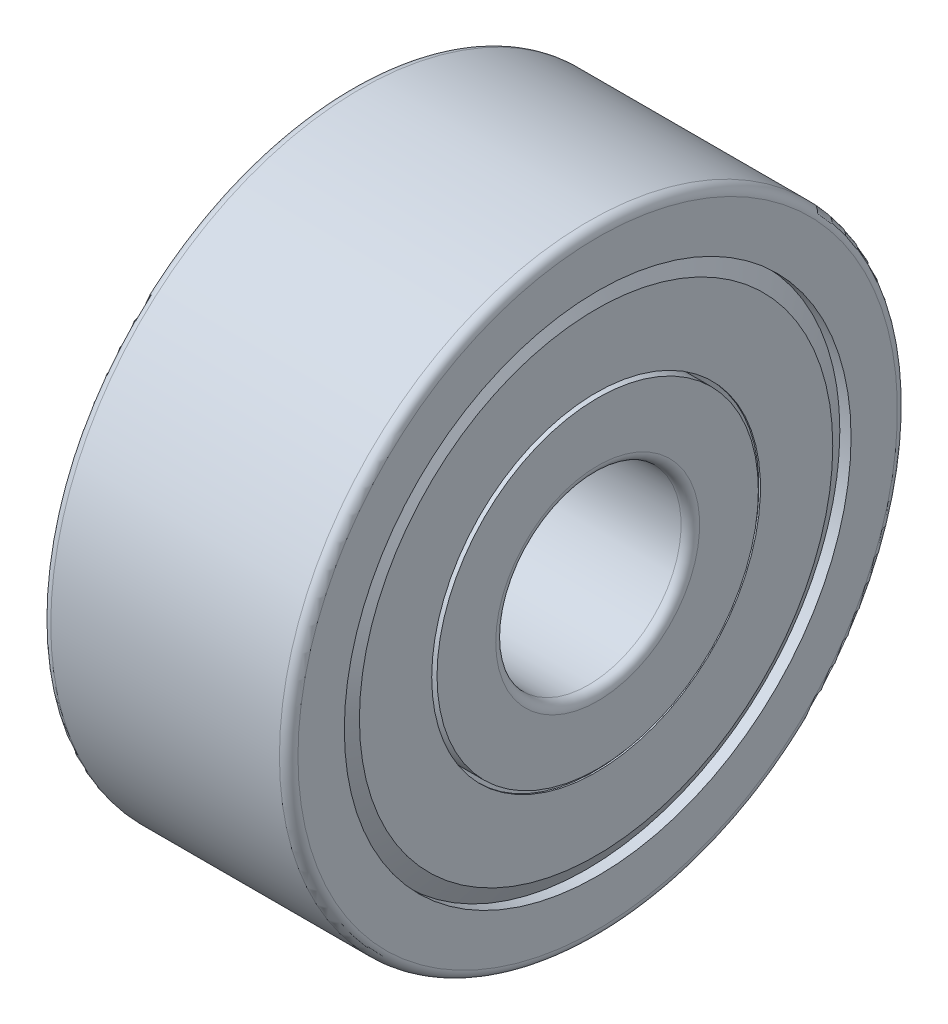
ISO-10303-21;
HEADER;
FILE_DESCRIPTION(('STEP AP214'),'2;1');
FILE_NAME('part.step','',(''),(''),'','','');
FILE_SCHEMA(('AUTOMOTIVE_DESIGN { 1 0 10303 214 1 1 1 1 }'));
ENDSEC;
DATA;
#1=APPLICATION_CONTEXT('core data for automotive mechanical design processes');
#2=APPLICATION_PROTOCOL_DEFINITION('international standard','automotive_design',2000,#1);
#3=PRODUCT_CONTEXT('',#1,'mechanical');
#4=PRODUCT('Part','Part','',(#3));
#5=PRODUCT_RELATED_PRODUCT_CATEGORY('part','',(#4));
#6=PRODUCT_DEFINITION_FORMATION('','',#4);
#7=PRODUCT_DEFINITION_CONTEXT('part definition',#1,'design');
#8=PRODUCT_DEFINITION('design','',#6,#7);
#9=PRODUCT_DEFINITION_SHAPE('','',#8);
#10=(LENGTH_UNIT() NAMED_UNIT(*) SI_UNIT(.MILLI.,.METRE.));
#11=(NAMED_UNIT(*) PLANE_ANGLE_UNIT() SI_UNIT($,.RADIAN.));
#12=(NAMED_UNIT(*) SI_UNIT($,.STERADIAN.) SOLID_ANGLE_UNIT());
#13=UNCERTAINTY_MEASURE_WITH_UNIT(LENGTH_MEASURE(1.E-05),#10,'distance_accuracy_value','');
#14=(GEOMETRIC_REPRESENTATION_CONTEXT(3) GLOBAL_UNCERTAINTY_ASSIGNED_CONTEXT((#13)) GLOBAL_UNIT_ASSIGNED_CONTEXT((#10,
#11,#12)) REPRESENTATION_CONTEXT('',''));
#15=CARTESIAN_POINT('',(0.,0.,0.));
#16=DIRECTION('',(0.,0.,1.));
#17=DIRECTION('',(1.,0.,0.));
#18=AXIS2_PLACEMENT_3D('',#15,#16,#17);
#19=CARTESIAN_POINT('',(4.,0.,0.));
#20=DIRECTION('',(-1.,0.,0.));
#21=DIRECTION('',(0.,0.,1.));
#22=AXIS2_PLACEMENT_3D('',#19,#20,#21);
#23=CYLINDRICAL_SURFACE('',#22,2.6);
#24=CARTESIAN_POINT('',(4.,0.,0.));
#25=DIRECTION('',(-1.,0.,0.));
#26=DIRECTION('',(0.,0.,1.));
#27=AXIS2_PLACEMENT_3D('',#24,#25,#26);
#28=CIRCLE('',#27,2.6);
#29=CARTESIAN_POINT('',(4.,0.,2.6));
#30=VERTEX_POINT('',#29);
#31=EDGE_CURVE('E10',#30,#30,#28,.T.);
#32=ORIENTED_EDGE('',*,*,#31,.T.);
#33=EDGE_LOOP('',(#32));
#34=FACE_BOUND('',#33,.T.);
#35=CARTESIAN_POINT('',(3.11246098558306,0.,0.));
#36=DIRECTION('',(-1.,0.,0.));
#37=DIRECTION('',(0.,0.,1.));
#38=AXIS2_PLACEMENT_3D('',#35,#36,#37);
#39=CIRCLE('',#38,2.6);
#40=CARTESIAN_POINT('',(3.11246098558306,0.,2.6));
#41=VERTEX_POINT('',#40);
#42=EDGE_CURVE('E143',#41,#41,#39,.T.);
#43=ORIENTED_EDGE('',*,*,#42,.F.);
#44=EDGE_LOOP('',(#43));
#45=FACE_BOUND('',#44,.T.);
#46=ADVANCED_FACE('F31',(#34,#45),#23,.T.);
#47=CARTESIAN_POINT('',(4.,2.6,0.));
#48=DIRECTION('',(1.,0.,0.));
#49=DIRECTION('',(0.,0.,-1.));
#50=AXIS2_PLACEMENT_3D('',#47,#48,#49);
#51=PLANE('',#50);
#52=CARTESIAN_POINT('',(4.,0.,0.));
#53=DIRECTION('',(-1.,0.,0.));
#54=DIRECTION('',(0.,0.,1.));
#55=AXIS2_PLACEMENT_3D('',#52,#53,#54);
#56=CIRCLE('',#55,1.65);
#57=CARTESIAN_POINT('',(4.,0.,1.65));
#58=VERTEX_POINT('',#57);
#59=EDGE_CURVE('E37',#58,#58,#56,.T.);
#60=ORIENTED_EDGE('',*,*,#59,.T.);
#61=EDGE_LOOP('',(#60));
#62=FACE_BOUND('',#61,.T.);
#63=ORIENTED_EDGE('',*,*,#31,.F.);
#64=EDGE_LOOP('',(#63));
#65=FACE_BOUND('',#64,.T.);
#66=ADVANCED_FACE('F151',(#62,#65),#51,.T.);
#67=CARTESIAN_POINT('',(3.85,0.,0.));
#68=DIRECTION('',(-1.,0.,0.));
#69=DIRECTION('',(0.,0.,1.));
#70=AXIS2_PLACEMENT_3D('',#67,#68,#69);
#71=TOROIDAL_SURFACE('',#70,1.65,0.15);
#72=CARTESIAN_POINT('',(3.85,0.,0.));
#73=DIRECTION('',(-1.,0.,0.));
#74=DIRECTION('',(0.,0.,1.));
#75=AXIS2_PLACEMENT_3D('',#72,#73,#74);
#76=CIRCLE('',#75,1.5);
#77=CARTESIAN_POINT('',(3.85,0.,1.5));
#78=VERTEX_POINT('',#77);
#79=EDGE_CURVE('E41',#78,#78,#76,.T.);
#80=ORIENTED_EDGE('',*,*,#79,.T.);
#81=EDGE_LOOP('',(#80));
#82=FACE_BOUND('',#81,.T.);
#83=ORIENTED_EDGE('',*,*,#59,.F.);
#84=EDGE_LOOP('',(#83));
#85=FACE_BOUND('',#84,.T.);
#86=ADVANCED_FACE('F155',(#82,#85),#71,.T.);
#87=CARTESIAN_POINT('',(4.,0.,0.));
#88=DIRECTION('',(-1.,0.,0.));
#89=DIRECTION('',(0.,0.,1.));
#90=AXIS2_PLACEMENT_3D('',#87,#88,#89);
#91=CYLINDRICAL_SURFACE('',#90,1.5);
#92=CARTESIAN_POINT('',(0.15,0.,0.));
#93=DIRECTION('',(-1.,0.,0.));
#94=DIRECTION('',(0.,0.,1.));
#95=AXIS2_PLACEMENT_3D('',#92,#93,#94);
#96=CIRCLE('',#95,1.5);
#97=CARTESIAN_POINT('',(0.15,0.,1.5));
#98=VERTEX_POINT('',#97);
#99=EDGE_CURVE('E45',#98,#98,#96,.T.);
#100=ORIENTED_EDGE('',*,*,#99,.T.);
#101=EDGE_LOOP('',(#100));
#102=FACE_BOUND('',#101,.T.);
#103=ORIENTED_EDGE('',*,*,#79,.F.);
#104=EDGE_LOOP('',(#103));
#105=FACE_BOUND('',#104,.T.);
#106=ADVANCED_FACE('F159',(#102,#105),#91,.F.);
#107=CARTESIAN_POINT('',(0.15,0.,0.));
#108=DIRECTION('',(-1.,0.,0.));
#109=DIRECTION('',(0.,0.,1.));
#110=AXIS2_PLACEMENT_3D('',#107,#108,#109);
#111=TOROIDAL_SURFACE('',#110,1.65,0.15);
#112=CARTESIAN_POINT('',(0.,0.,0.));
#113=DIRECTION('',(-1.,0.,0.));
#114=DIRECTION('',(0.,0.,1.));
#115=AXIS2_PLACEMENT_3D('',#112,#113,#114);
#116=CIRCLE('',#115,1.65);
#117=CARTESIAN_POINT('',(0.,0.,1.65));
#118=VERTEX_POINT('',#117);
#119=EDGE_CURVE('E50',#118,#118,#116,.T.);
#120=ORIENTED_EDGE('',*,*,#119,.T.);
#121=EDGE_LOOP('',(#120));
#122=FACE_BOUND('',#121,.T.);
#123=ORIENTED_EDGE('',*,*,#99,.F.);
#124=EDGE_LOOP('',(#123));
#125=FACE_BOUND('',#124,.T.);
#126=ADVANCED_FACE('F166',(#122,#125),#111,.T.);
#127=CARTESIAN_POINT('',(0.,1.65,0.));
#128=DIRECTION('',(-1.,0.,0.));
#129=DIRECTION('',(0.,0.,1.));
#130=AXIS2_PLACEMENT_3D('',#127,#128,#129);
#131=PLANE('',#130);
#132=CARTESIAN_POINT('',(0.,0.,0.));
#133=DIRECTION('',(-1.,0.,0.));
#134=DIRECTION('',(0.,0.,1.));
#135=AXIS2_PLACEMENT_3D('',#132,#133,#134);
#136=CIRCLE('',#135,2.6);
#137=CARTESIAN_POINT('',(0.,0.,2.6));
#138=VERTEX_POINT('',#137);
#139=EDGE_CURVE('E53',#138,#138,#136,.T.);
#140=ORIENTED_EDGE('',*,*,#139,.T.);
#141=EDGE_LOOP('',(#140));
#142=FACE_BOUND('',#141,.T.);
#143=ORIENTED_EDGE('',*,*,#119,.F.);
#144=EDGE_LOOP('',(#143));
#145=FACE_BOUND('',#144,.T.);
#146=ADVANCED_FACE('F170',(#142,#145),#131,.T.);
#147=CARTESIAN_POINT('',(4.,0.,0.));
#148=DIRECTION('',(-1.,0.,0.));
#149=DIRECTION('',(0.,0.,1.));
#150=AXIS2_PLACEMENT_3D('',#147,#148,#149);
#151=CYLINDRICAL_SURFACE('',#150,2.6);
#152=CARTESIAN_POINT('',(0.887539014416936,0.,0.));
#153=DIRECTION('',(-1.,0.,0.));
#154=DIRECTION('',(0.,0.,1.));
#155=AXIS2_PLACEMENT_3D('',#152,#153,#154);
#156=CIRCLE('',#155,2.6);
#157=CARTESIAN_POINT('',(0.887539014416936,0.,2.6));
#158=VERTEX_POINT('',#157);
#159=EDGE_CURVE('E56',#158,#158,#156,.T.);
#160=ORIENTED_EDGE('',*,*,#159,.T.);
#161=EDGE_LOOP('',(#160));
#162=FACE_BOUND('',#161,.T.);
#163=ORIENTED_EDGE('',*,*,#139,.F.);
#164=EDGE_LOOP('',(#163));
#165=FACE_BOUND('',#164,.T.);
#166=ADVANCED_FACE('F174',(#162,#165),#151,.T.);
#167=CARTESIAN_POINT('',(2.,0.,0.));
#168=DIRECTION('',(-1.,0.,0.));
#169=DIRECTION('',(0.,0.,1.));
#170=AXIS2_PLACEMENT_3D('',#167,#168,#169);
#171=TOROIDAL_SURFACE('',#170,3.35,1.34166666666667);
#172=CARTESIAN_POINT('',(0.754982150953472,0.,0.));
#173=DIRECTION('',(-1.,0.,0.));
#174=DIRECTION('',(0.,0.,1.));
#175=AXIS2_PLACEMENT_3D('',#172,#173,#174);
#176=CIRCLE('',#175,3.85);
#177=CARTESIAN_POINT('',(0.754982150953472,0.,3.85));
#178=VERTEX_POINT('',#177);
#179=EDGE_CURVE('E59',#178,#178,#176,.T.);
#180=ORIENTED_EDGE('',*,*,#179,.T.);
#181=EDGE_LOOP('',(#180));
#182=FACE_BOUND('',#181,.T.);
#183=ORIENTED_EDGE('',*,*,#159,.F.);
#184=EDGE_LOOP('',(#183));
#185=FACE_BOUND('',#184,.T.);
#186=ADVANCED_FACE('F178',(#182,#185),#171,.T.);
#187=CARTESIAN_POINT('',(4.,0.,0.));
#188=DIRECTION('',(-1.,0.,0.));
#189=DIRECTION('',(0.,0.,1.));
#190=AXIS2_PLACEMENT_3D('',#187,#188,#189);
#191=CYLINDRICAL_SURFACE('',#190,3.85);
#192=CARTESIAN_POINT('',(0.363636363636364,0.,0.));
#193=DIRECTION('',(-1.,0.,0.));
#194=DIRECTION('',(0.,0.,1.));
#195=AXIS2_PLACEMENT_3D('',#192,#193,#194);
#196=CIRCLE('',#195,3.85);
#197=CARTESIAN_POINT('',(0.363636363636364,0.,3.85));
#198=VERTEX_POINT('',#197);
#199=EDGE_CURVE('E62',#198,#198,#196,.T.);
#200=ORIENTED_EDGE('',*,*,#199,.T.);
#201=EDGE_LOOP('',(#200));
#202=FACE_BOUND('',#201,.T.);
#203=ORIENTED_EDGE('',*,*,#179,.F.);
#204=EDGE_LOOP('',(#203));
#205=FACE_BOUND('',#204,.T.);
#206=ADVANCED_FACE('F182',(#202,#205),#191,.F.);
#207=CARTESIAN_POINT('',(0.363636363636353,3.85,0.));
#208=DIRECTION('',(-1.,0.,0.));
#209=DIRECTION('',(0.,0.,1.));
#210=AXIS2_PLACEMENT_3D('',#207,#208,#209);
#211=PLANE('',#210);
#212=CARTESIAN_POINT('',(0.363636363636343,0.,0.));
#213=DIRECTION('',(-1.,0.,0.));
#214=DIRECTION('',(0.,0.,1.));
#215=AXIS2_PLACEMENT_3D('',#212,#213,#214);
#216=CIRCLE('',#215,4.09999999999993);
#217=CARTESIAN_POINT('',(0.363636363636343,0.,4.09999999999993));
#218=VERTEX_POINT('',#217);
#219=EDGE_CURVE('E65',#218,#218,#216,.T.);
#220=ORIENTED_EDGE('',*,*,#219,.T.);
#221=EDGE_LOOP('',(#220));
#222=FACE_BOUND('',#221,.T.);
#223=ORIENTED_EDGE('',*,*,#199,.F.);
#224=EDGE_LOOP('',(#223));
#225=FACE_BOUND('',#224,.T.);
#226=ADVANCED_FACE('F186',(#222,#225),#211,.T.);
#227=CARTESIAN_POINT('',(0.272727272727262,0.,0.));
#228=DIRECTION('',(-1.,0.,0.));
#229=DIRECTION('',(0.,0.,1.));
#230=AXIS2_PLACEMENT_3D('',#227,#228,#229);
#231=TOROIDAL_SURFACE('',#230,4.09999999999993,0.0909090909090812);
#232=CARTESIAN_POINT('',(0.259019852562109,0.,0.));
#233=DIRECTION('',(-1.,0.,0.));
#234=DIRECTION('',(0.,0.,1.));
#235=AXIS2_PLACEMENT_3D('',#232,#233,#234);
#236=CIRCLE('',#235,4.18986973596444);
#237=CARTESIAN_POINT('',(0.259019852562109,0.,4.18986973596444));
#238=VERTEX_POINT('',#237);
#239=EDGE_CURVE('E68',#238,#238,#236,.T.);
#240=ORIENTED_EDGE('',*,*,#239,.T.);
#241=EDGE_LOOP('',(#240));
#242=FACE_BOUND('',#241,.T.);
#243=ORIENTED_EDGE('',*,*,#219,.F.);
#244=EDGE_LOOP('',(#243));
#245=FACE_BOUND('',#244,.T.);
#246=ADVANCED_FACE('F190',(#242,#245),#231,.F.);
#247=CARTESIAN_POINT('',(0.259019852562109,0.,0.));
#248=DIRECTION('',(-1.,0.,0.));
#249=DIRECTION('',(0.,0.,1.));
#250=AXIS2_PLACEMENT_3D('',#247,#248,#249);
#251=CONICAL_SURFACE('',#250,4.18986973596444,0.523598775608689);
#252=CARTESIAN_POINT('',(0.261825317547306,0.,0.));
#253=DIRECTION('',(-1.,0.,0.));
#254=DIRECTION('',(0.,0.,1.));
#255=AXIS2_PLACEMENT_3D('',#252,#253,#254);
#256=CIRCLE('',#255,4.18825);
#257=CARTESIAN_POINT('',(0.261825317547306,0.,4.18825));
#258=VERTEX_POINT('',#257);
#259=EDGE_CURVE('E71',#258,#258,#256,.T.);
#260=ORIENTED_EDGE('',*,*,#259,.T.);
#261=EDGE_LOOP('',(#260));
#262=FACE_BOUND('',#261,.T.);
#263=ORIENTED_EDGE('',*,*,#239,.F.);
#264=EDGE_LOOP('',(#263));
#265=FACE_BOUND('',#264,.T.);
#266=ADVANCED_FACE('F194',(#262,#265),#251,.T.);
#267=CARTESIAN_POINT('',(0.261825317547306,0.,0.));
#268=DIRECTION('',(1.,0.,0.));
#269=DIRECTION('',(0.,0.,-1.));
#270=AXIS2_PLACEMENT_3D('',#267,#268,#269);
#271=CONICAL_SURFACE('',#270,4.18825,1.04719755119659);
#272=CARTESIAN_POINT('',(0.0509999999999998,0.,0.));
#273=DIRECTION('',(-1.,0.,0.));
#274=DIRECTION('',(0.,0.,1.));
#275=AXIS2_PLACEMENT_3D('',#272,#273,#274);
#276=CIRCLE('',#275,3.82308983848623);
#277=CARTESIAN_POINT('',(0.0509999999999998,0.,3.82308983848623));
#278=VERTEX_POINT('',#277);
#279=EDGE_CURVE('E74',#278,#278,#276,.T.);
#280=ORIENTED_EDGE('',*,*,#279,.T.);
#281=EDGE_LOOP('',(#280));
#282=FACE_BOUND('',#281,.T.);
#283=ORIENTED_EDGE('',*,*,#259,.F.);
#284=EDGE_LOOP('',(#283));
#285=FACE_BOUND('',#284,.T.);
#286=ADVANCED_FACE('F198',(#282,#285),#271,.F.);
#287=CARTESIAN_POINT('',(0.0509999999999999,3.82308983848623,0.));
#288=DIRECTION('',(1.,0.,0.));
#289=DIRECTION('',(0.,0.,-1.));
#290=AXIS2_PLACEMENT_3D('',#287,#288,#289);
#291=PLANE('',#290);
#292=CARTESIAN_POINT('',(0.0509999999999998,0.,0.));
#293=DIRECTION('',(-1.,0.,0.));
#294=DIRECTION('',(0.,0.,1.));
#295=AXIS2_PLACEMENT_3D('',#292,#293,#294);
#296=CIRCLE('',#295,2.65999999999992);
#297=CARTESIAN_POINT('',(0.0509999999999998,0.,2.65999999999992));
#298=VERTEX_POINT('',#297);
#299=EDGE_CURVE('E77',#298,#298,#296,.T.);
#300=ORIENTED_EDGE('',*,*,#299,.T.);
#301=EDGE_LOOP('',(#300));
#302=FACE_BOUND('',#301,.T.);
#303=ORIENTED_EDGE('',*,*,#279,.F.);
#304=EDGE_LOOP('',(#303));
#305=FACE_BOUND('',#304,.T.);
#306=ADVANCED_FACE('F202',(#302,#305),#291,.T.);
#307=CARTESIAN_POINT('',(4.,0.,0.));
#308=DIRECTION('',(-1.,0.,0.));
#309=DIRECTION('',(0.,0.,1.));
#310=AXIS2_PLACEMENT_3D('',#307,#308,#309);
#311=CYLINDRICAL_SURFACE('',#310,2.65999999999992);
#312=CARTESIAN_POINT('',(0.0259999999999826,0.,0.));
#313=DIRECTION('',(-1.,0.,0.));
#314=DIRECTION('',(0.,0.,1.));
#315=AXIS2_PLACEMENT_3D('',#312,#313,#314);
#316=CIRCLE('',#315,2.65999999999992);
#317=CARTESIAN_POINT('',(0.0259999999999826,0.,2.65999999999992));
#318=VERTEX_POINT('',#317);
#319=EDGE_CURVE('E80',#318,#318,#316,.T.);
#320=ORIENTED_EDGE('',*,*,#319,.T.);
#321=EDGE_LOOP('',(#320));
#322=FACE_BOUND('',#321,.T.);
#323=ORIENTED_EDGE('',*,*,#299,.F.);
#324=EDGE_LOOP('',(#323));
#325=FACE_BOUND('',#324,.T.);
#326=ADVANCED_FACE('F206',(#322,#325),#311,.F.);
#327=CARTESIAN_POINT('',(0.0259999999999823,2.65999999999992,0.));
#328=DIRECTION('',(-1.,0.,0.));
#329=DIRECTION('',(0.,0.,1.));
#330=AXIS2_PLACEMENT_3D('',#327,#328,#329);
#331=PLANE('',#330);
#332=CARTESIAN_POINT('',(0.0259999999999826,0.,0.));
#333=DIRECTION('',(-1.,0.,0.));
#334=DIRECTION('',(0.,0.,1.));
#335=AXIS2_PLACEMENT_3D('',#332,#333,#334);
#336=CIRCLE('',#335,3.82978856829693);
#337=CARTESIAN_POINT('',(0.0259999999999826,0.,3.82978856829693));
#338=VERTEX_POINT('',#337);
#339=EDGE_CURVE('E83',#338,#338,#336,.T.);
#340=ORIENTED_EDGE('',*,*,#339,.T.);
#341=EDGE_LOOP('',(#340));
#342=FACE_BOUND('',#341,.T.);
#343=ORIENTED_EDGE('',*,*,#319,.F.);
#344=EDGE_LOOP('',(#343));
#345=FACE_BOUND('',#344,.T.);
#346=ADVANCED_FACE('F210',(#342,#345),#331,.T.);
#347=CARTESIAN_POINT('',(0.0259999999999826,0.,0.));
#348=DIRECTION('',(1.,0.,0.));
#349=DIRECTION('',(0.,0.,-1.));
#350=AXIS2_PLACEMENT_3D('',#347,#348,#349);
#351=CONICAL_SURFACE('',#350,3.82978856829693,1.04719755119676);
#352=CARTESIAN_POINT('',(0.227554836368259,0.,0.));
#353=DIRECTION('',(-1.,0.,0.));
#354=DIRECTION('',(0.,0.,1.));
#355=AXIS2_PLACEMENT_3D('',#352,#353,#354);
#356=CIRCLE('',#355,4.17889178539815);
#357=CARTESIAN_POINT('',(0.227554836368259,0.,4.17889178539815));
#358=VERTEX_POINT('',#357);
#359=EDGE_CURVE('E86',#358,#358,#356,.T.);
#360=ORIENTED_EDGE('',*,*,#359,.T.);
#361=EDGE_LOOP('',(#360));
#362=FACE_BOUND('',#361,.T.);
#363=ORIENTED_EDGE('',*,*,#339,.F.);
#364=EDGE_LOOP('',(#363));
#365=FACE_BOUND('',#364,.T.);
#366=ADVANCED_FACE('F214',(#362,#365),#351,.T.);
#367=CARTESIAN_POINT('',(0.272727272727262,0.,0.));
#368=DIRECTION('',(-1.,0.,0.));
#369=DIRECTION('',(0.,0.,1.));
#370=AXIS2_PLACEMENT_3D('',#367,#368,#369);
#371=TOROIDAL_SURFACE('',#370,4.09999999999993,0.090909090909141);
#372=CARTESIAN_POINT('',(0.181818181818121,0.,0.));
#373=DIRECTION('',(-1.,0.,0.));
#374=DIRECTION('',(0.,0.,1.));
#375=AXIS2_PLACEMENT_3D('',#372,#373,#374);
#376=CIRCLE('',#375,4.09999999999996);
#377=CARTESIAN_POINT('',(0.181818181818121,0.,4.09999999999996));
#378=VERTEX_POINT('',#377);
#379=EDGE_CURVE('E89',#378,#378,#376,.T.);
#380=ORIENTED_EDGE('',*,*,#379,.T.);
#381=EDGE_LOOP('',(#380));
#382=FACE_BOUND('',#381,.T.);
#383=ORIENTED_EDGE('',*,*,#359,.F.);
#384=EDGE_LOOP('',(#383));
#385=FACE_BOUND('',#384,.T.);
#386=ADVANCED_FACE('F218',(#382,#385),#371,.F.);
#387=CARTESIAN_POINT('',(4.,0.,0.));
#388=DIRECTION('',(-1.,0.,0.));
#389=DIRECTION('',(0.,0.,1.));
#390=AXIS2_PLACEMENT_3D('',#387,#388,#389);
#391=CYLINDRICAL_SURFACE('',#390,4.09999999999995);
#392=CARTESIAN_POINT('',(0.,0.,0.));
#393=DIRECTION('',(-1.,0.,0.));
#394=DIRECTION('',(0.,0.,1.));
#395=AXIS2_PLACEMENT_3D('',#392,#393,#394);
#396=CIRCLE('',#395,4.09999999999993);
#397=CARTESIAN_POINT('',(0.,0.,4.09999999999993));
#398=VERTEX_POINT('',#397);
#399=EDGE_CURVE('E92',#398,#398,#396,.T.);
#400=ORIENTED_EDGE('',*,*,#399,.T.);
#401=EDGE_LOOP('',(#400));
#402=FACE_BOUND('',#401,.T.);
#403=ORIENTED_EDGE('',*,*,#379,.F.);
#404=EDGE_LOOP('',(#403));
#405=FACE_BOUND('',#404,.T.);
#406=ADVANCED_FACE('F222',(#402,#405),#391,.F.);
#407=CARTESIAN_POINT('',(0.,4.09999999999993,0.));
#408=DIRECTION('',(-1.,0.,0.));
#409=DIRECTION('',(0.,0.,1.));
#410=AXIS2_PLACEMENT_3D('',#407,#408,#409);
#411=PLANE('',#410);
#412=CARTESIAN_POINT('',(0.,0.,0.));
#413=DIRECTION('',(-1.,0.,0.));
#414=DIRECTION('',(0.,0.,1.));
#415=AXIS2_PLACEMENT_3D('',#412,#413,#414);
#416=CIRCLE('',#415,4.85);
#417=CARTESIAN_POINT('',(0.,0.,4.85));
#418=VERTEX_POINT('',#417);
#419=EDGE_CURVE('E95',#418,#418,#416,.T.);
#420=ORIENTED_EDGE('',*,*,#419,.T.);
#421=EDGE_LOOP('',(#420));
#422=FACE_BOUND('',#421,.T.);
#423=ORIENTED_EDGE('',*,*,#399,.F.);
#424=EDGE_LOOP('',(#423));
#425=FACE_BOUND('',#424,.T.);
#426=ADVANCED_FACE('F226',(#422,#425),#411,.T.);
#427=CARTESIAN_POINT('',(0.15,0.,0.));
#428=DIRECTION('',(-1.,0.,0.));
#429=DIRECTION('',(0.,0.,1.));
#430=AXIS2_PLACEMENT_3D('',#427,#428,#429);
#431=TOROIDAL_SURFACE('',#430,4.85,0.15);
#432=CARTESIAN_POINT('',(0.15,0.,0.));
#433=DIRECTION('',(-1.,0.,0.));
#434=DIRECTION('',(0.,0.,1.));
#435=AXIS2_PLACEMENT_3D('',#432,#433,#434);
#436=CIRCLE('',#435,5.);
#437=CARTESIAN_POINT('',(0.15,0.,5.));
#438=VERTEX_POINT('',#437);
#439=EDGE_CURVE('E98',#438,#438,#436,.T.);
#440=ORIENTED_EDGE('',*,*,#439,.T.);
#441=EDGE_LOOP('',(#440));
#442=FACE_BOUND('',#441,.T.);
#443=ORIENTED_EDGE('',*,*,#419,.F.);
#444=EDGE_LOOP('',(#443));
#445=FACE_BOUND('',#444,.T.);
#446=ADVANCED_FACE('F230',(#442,#445),#431,.T.);
#447=CARTESIAN_POINT('',(4.,0.,0.));
#448=DIRECTION('',(-1.,0.,0.));
#449=DIRECTION('',(0.,0.,1.));
#450=AXIS2_PLACEMENT_3D('',#447,#448,#449);
#451=CYLINDRICAL_SURFACE('',#450,5.);
#452=CARTESIAN_POINT('',(3.85,0.,0.));
#453=DIRECTION('',(-1.,0.,0.));
#454=DIRECTION('',(0.,0.,1.));
#455=AXIS2_PLACEMENT_3D('',#452,#453,#454);
#456=CIRCLE('',#455,5.);
#457=CARTESIAN_POINT('',(3.85,0.,5.));
#458=VERTEX_POINT('',#457);
#459=EDGE_CURVE('E101',#458,#458,#456,.T.);
#460=ORIENTED_EDGE('',*,*,#459,.T.);
#461=EDGE_LOOP('',(#460));
#462=FACE_BOUND('',#461,.T.);
#463=ORIENTED_EDGE('',*,*,#439,.F.);
#464=EDGE_LOOP('',(#463));
#465=FACE_BOUND('',#464,.T.);
#466=ADVANCED_FACE('F234',(#462,#465),#451,.T.);
#467=CARTESIAN_POINT('',(3.85,0.,0.));
#468=DIRECTION('',(-1.,0.,0.));
#469=DIRECTION('',(0.,0.,1.));
#470=AXIS2_PLACEMENT_3D('',#467,#468,#469);
#471=TOROIDAL_SURFACE('',#470,4.85,0.15);
#472=CARTESIAN_POINT('',(4.,0.,0.));
#473=DIRECTION('',(-1.,0.,0.));
#474=DIRECTION('',(0.,0.,1.));
#475=AXIS2_PLACEMENT_3D('',#472,#473,#474);
#476=CIRCLE('',#475,4.85);
#477=CARTESIAN_POINT('',(4.,0.,4.85));
#478=VERTEX_POINT('',#477);
#479=EDGE_CURVE('E104',#478,#478,#476,.T.);
#480=ORIENTED_EDGE('',*,*,#479,.T.);
#481=EDGE_LOOP('',(#480));
#482=FACE_BOUND('',#481,.T.);
#483=ORIENTED_EDGE('',*,*,#459,.F.);
#484=EDGE_LOOP('',(#483));
#485=FACE_BOUND('',#484,.T.);
#486=ADVANCED_FACE('F238',(#482,#485),#471,.T.);
#487=CARTESIAN_POINT('',(4.,4.85,0.));
#488=DIRECTION('',(1.,0.,0.));
#489=DIRECTION('',(0.,0.,-1.));
#490=AXIS2_PLACEMENT_3D('',#487,#488,#489);
#491=PLANE('',#490);
#492=CARTESIAN_POINT('',(4.,0.,0.));
#493=DIRECTION('',(-1.,0.,0.));
#494=DIRECTION('',(0.,0.,1.));
#495=AXIS2_PLACEMENT_3D('',#492,#493,#494);
#496=CIRCLE('',#495,4.09999999999993);
#497=CARTESIAN_POINT('',(4.,0.,4.09999999999993));
#498=VERTEX_POINT('',#497);
#499=EDGE_CURVE('E107',#498,#498,#496,.T.);
#500=ORIENTED_EDGE('',*,*,#499,.T.);
#501=EDGE_LOOP('',(#500));
#502=FACE_BOUND('',#501,.T.);
#503=ORIENTED_EDGE('',*,*,#479,.F.);
#504=EDGE_LOOP('',(#503));
#505=FACE_BOUND('',#504,.T.);
#506=ADVANCED_FACE('F242',(#502,#505),#491,.T.);
#507=CARTESIAN_POINT('',(4.,0.,0.));
#508=DIRECTION('',(-1.,0.,0.));
#509=DIRECTION('',(0.,0.,1.));
#510=AXIS2_PLACEMENT_3D('',#507,#508,#509);
#511=CYLINDRICAL_SURFACE('',#510,4.09999999999993);
#512=CARTESIAN_POINT('',(3.81818181818182,0.,0.));
#513=DIRECTION('',(-1.,0.,0.));
#514=DIRECTION('',(0.,0.,1.));
#515=AXIS2_PLACEMENT_3D('',#512,#513,#514);
#516=CIRCLE('',#515,4.09999999999993);
#517=CARTESIAN_POINT('',(3.81818181818182,0.,4.09999999999993));
#518=VERTEX_POINT('',#517);
#519=EDGE_CURVE('E110',#518,#518,#516,.T.);
#520=ORIENTED_EDGE('',*,*,#519,.T.);
#521=EDGE_LOOP('',(#520));
#522=FACE_BOUND('',#521,.T.);
#523=ORIENTED_EDGE('',*,*,#499,.F.);
#524=EDGE_LOOP('',(#523));
#525=FACE_BOUND('',#524,.T.);
#526=ADVANCED_FACE('F246',(#522,#525),#511,.F.);
#527=CARTESIAN_POINT('',(3.72727272727272,0.,0.));
#528=DIRECTION('',(-1.,0.,0.));
#529=DIRECTION('',(0.,0.,1.));
#530=AXIS2_PLACEMENT_3D('',#527,#528,#529);
#531=TOROIDAL_SURFACE('',#530,4.09999999999993,0.0909090909091003);
#532=CARTESIAN_POINT('',(3.77244516363163,0.,0.));
#533=DIRECTION('',(-1.,0.,0.));
#534=DIRECTION('',(0.,0.,1.));
#535=AXIS2_PLACEMENT_3D('',#532,#533,#534);
#536=CIRCLE('',#535,4.17889178539815);
#537=CARTESIAN_POINT('',(3.77244516363163,0.,4.17889178539815));
#538=VERTEX_POINT('',#537);
#539=EDGE_CURVE('E113',#538,#538,#536,.T.);
#540=ORIENTED_EDGE('',*,*,#539,.T.);
#541=EDGE_LOOP('',(#540));
#542=FACE_BOUND('',#541,.T.);
#543=ORIENTED_EDGE('',*,*,#519,.F.);
#544=EDGE_LOOP('',(#543));
#545=FACE_BOUND('',#544,.T.);
#546=ADVANCED_FACE('F250',(#542,#545),#531,.F.);
#547=CARTESIAN_POINT('',(3.77244516363163,0.,0.));
#548=DIRECTION('',(-1.,0.,0.));
#549=DIRECTION('',(0.,0.,1.));
#550=AXIS2_PLACEMENT_3D('',#547,#548,#549);
#551=CONICAL_SURFACE('',#550,4.17889178539815,1.0471975511966);
#552=CARTESIAN_POINT('',(3.97399999999998,0.,0.));
#553=DIRECTION('',(-1.,0.,0.));
#554=DIRECTION('',(0.,0.,1.));
#555=AXIS2_PLACEMENT_3D('',#552,#553,#554);
#556=CIRCLE('',#555,3.82978856829693);
#557=CARTESIAN_POINT('',(3.97399999999998,0.,3.82978856829693));
#558=VERTEX_POINT('',#557);
#559=EDGE_CURVE('E116',#558,#558,#556,.T.);
#560=ORIENTED_EDGE('',*,*,#559,.T.);
#561=EDGE_LOOP('',(#560));
#562=FACE_BOUND('',#561,.T.);
#563=ORIENTED_EDGE('',*,*,#539,.F.);
#564=EDGE_LOOP('',(#563));
#565=FACE_BOUND('',#564,.T.);
#566=ADVANCED_FACE('F254',(#562,#565),#551,.T.);
#567=CARTESIAN_POINT('',(3.97399999999998,3.82978856829693,0.));
#568=DIRECTION('',(1.,0.,0.));
#569=DIRECTION('',(0.,0.,-1.));
#570=AXIS2_PLACEMENT_3D('',#567,#568,#569);
#571=PLANE('',#570);
#572=CARTESIAN_POINT('',(3.97399999999998,0.,0.));
#573=DIRECTION('',(-1.,0.,0.));
#574=DIRECTION('',(0.,0.,1.));
#575=AXIS2_PLACEMENT_3D('',#572,#573,#574);
#576=CIRCLE('',#575,2.65999999999992);
#577=CARTESIAN_POINT('',(3.97399999999998,0.,2.65999999999992));
#578=VERTEX_POINT('',#577);
#579=EDGE_CURVE('E119',#578,#578,#576,.T.);
#580=ORIENTED_EDGE('',*,*,#579,.T.);
#581=EDGE_LOOP('',(#580));
#582=FACE_BOUND('',#581,.T.);
#583=ORIENTED_EDGE('',*,*,#559,.F.);
#584=EDGE_LOOP('',(#583));
#585=FACE_BOUND('',#584,.T.);
#586=ADVANCED_FACE('F258',(#582,#585),#571,.T.);
#587=CARTESIAN_POINT('',(4.,0.,0.));
#588=DIRECTION('',(-1.,0.,0.));
#589=DIRECTION('',(0.,0.,1.));
#590=AXIS2_PLACEMENT_3D('',#587,#588,#589);
#591=CYLINDRICAL_SURFACE('',#590,2.65999999999992);
#592=CARTESIAN_POINT('',(3.949,0.,0.));
#593=DIRECTION('',(-1.,0.,0.));
#594=DIRECTION('',(0.,0.,1.));
#595=AXIS2_PLACEMENT_3D('',#592,#593,#594);
#596=CIRCLE('',#595,2.65999999999992);
#597=CARTESIAN_POINT('',(3.949,0.,2.65999999999992));
#598=VERTEX_POINT('',#597);
#599=EDGE_CURVE('E122',#598,#598,#596,.T.);
#600=ORIENTED_EDGE('',*,*,#599,.T.);
#601=EDGE_LOOP('',(#600));
#602=FACE_BOUND('',#601,.T.);
#603=ORIENTED_EDGE('',*,*,#579,.F.);
#604=EDGE_LOOP('',(#603));
#605=FACE_BOUND('',#604,.T.);
#606=ADVANCED_FACE('F262',(#602,#605),#591,.F.);
#607=CARTESIAN_POINT('',(3.949,2.65999999999992,0.));
#608=DIRECTION('',(-1.,0.,0.));
#609=DIRECTION('',(0.,0.,1.));
#610=AXIS2_PLACEMENT_3D('',#607,#608,#609);
#611=PLANE('',#610);
#612=CARTESIAN_POINT('',(3.949,0.,0.));
#613=DIRECTION('',(-1.,0.,0.));
#614=DIRECTION('',(0.,0.,1.));
#615=AXIS2_PLACEMENT_3D('',#612,#613,#614);
#616=CIRCLE('',#615,3.82308983848623);
#617=CARTESIAN_POINT('',(3.949,0.,3.82308983848623));
#618=VERTEX_POINT('',#617);
#619=EDGE_CURVE('E125',#618,#618,#616,.T.);
#620=ORIENTED_EDGE('',*,*,#619,.T.);
#621=EDGE_LOOP('',(#620));
#622=FACE_BOUND('',#621,.T.);
#623=ORIENTED_EDGE('',*,*,#599,.F.);
#624=EDGE_LOOP('',(#623));
#625=FACE_BOUND('',#624,.T.);
#626=ADVANCED_FACE('F266',(#622,#625),#611,.T.);
#627=CARTESIAN_POINT('',(3.949,0.,0.));
#628=DIRECTION('',(-1.,0.,0.));
#629=DIRECTION('',(0.,0.,1.));
#630=AXIS2_PLACEMENT_3D('',#627,#628,#629);
#631=CONICAL_SURFACE('',#630,3.82308983848623,1.0471975511966);
#632=CARTESIAN_POINT('',(3.7381746824527,0.,0.));
#633=DIRECTION('',(-1.,0.,0.));
#634=DIRECTION('',(0.,0.,1.));
#635=AXIS2_PLACEMENT_3D('',#632,#633,#634);
#636=CIRCLE('',#635,4.18825);
#637=CARTESIAN_POINT('',(3.7381746824527,0.,4.18825));
#638=VERTEX_POINT('',#637);
#639=EDGE_CURVE('E128',#638,#638,#636,.T.);
#640=ORIENTED_EDGE('',*,*,#639,.T.);
#641=EDGE_LOOP('',(#640));
#642=FACE_BOUND('',#641,.T.);
#643=ORIENTED_EDGE('',*,*,#619,.F.);
#644=EDGE_LOOP('',(#643));
#645=FACE_BOUND('',#644,.T.);
#646=ADVANCED_FACE('F270',(#642,#645),#631,.F.);
#647=CARTESIAN_POINT('',(3.7381746824527,0.,0.));
#648=DIRECTION('',(1.,0.,0.));
#649=DIRECTION('',(0.,0.,-1.));
#650=AXIS2_PLACEMENT_3D('',#647,#648,#649);
#651=CONICAL_SURFACE('',#650,4.18825,0.52359877559852);
#652=CARTESIAN_POINT('',(3.74098014743795,0.,0.));
#653=DIRECTION('',(-1.,0.,0.));
#654=DIRECTION('',(0.,0.,1.));
#655=AXIS2_PLACEMENT_3D('',#652,#653,#654);
#656=CIRCLE('',#655,4.18986973596444);
#657=CARTESIAN_POINT('',(3.74098014743795,0.,4.18986973596444));
#658=VERTEX_POINT('',#657);
#659=EDGE_CURVE('E131',#658,#658,#656,.T.);
#660=ORIENTED_EDGE('',*,*,#659,.T.);
#661=EDGE_LOOP('',(#660));
#662=FACE_BOUND('',#661,.T.);
#663=ORIENTED_EDGE('',*,*,#639,.F.);
#664=EDGE_LOOP('',(#663));
#665=FACE_BOUND('',#664,.T.);
#666=ADVANCED_FACE('F274',(#662,#665),#651,.T.);
#667=CARTESIAN_POINT('',(3.72727272727272,0.,0.));
#668=DIRECTION('',(-1.,0.,0.));
#669=DIRECTION('',(0.,0.,1.));
#670=AXIS2_PLACEMENT_3D('',#667,#668,#669);
#671=TOROIDAL_SURFACE('',#670,4.09999999999993,0.0909090909090932);
#672=CARTESIAN_POINT('',(3.63636363636363,0.,0.));
#673=DIRECTION('',(-1.,0.,0.));
#674=DIRECTION('',(0.,0.,1.));
#675=AXIS2_PLACEMENT_3D('',#672,#673,#674);
#676=CIRCLE('',#675,4.09999999999993);
#677=CARTESIAN_POINT('',(3.63636363636363,0.,4.09999999999993));
#678=VERTEX_POINT('',#677);
#679=EDGE_CURVE('E134',#678,#678,#676,.T.);
#680=ORIENTED_EDGE('',*,*,#679,.T.);
#681=EDGE_LOOP('',(#680));
#682=FACE_BOUND('',#681,.T.);
#683=ORIENTED_EDGE('',*,*,#659,.F.);
#684=EDGE_LOOP('',(#683));
#685=FACE_BOUND('',#684,.T.);
#686=ADVANCED_FACE('F278',(#682,#685),#671,.F.);
#687=CARTESIAN_POINT('',(3.63636363636363,4.09999999999993,0.));
#688=DIRECTION('',(1.,0.,0.));
#689=DIRECTION('',(0.,0.,-1.));
#690=AXIS2_PLACEMENT_3D('',#687,#688,#689);
#691=PLANE('',#690);
#692=CARTESIAN_POINT('',(3.63636363636363,0.,0.));
#693=DIRECTION('',(-1.,0.,0.));
#694=DIRECTION('',(0.,0.,1.));
#695=AXIS2_PLACEMENT_3D('',#692,#693,#694);
#696=CIRCLE('',#695,3.85);
#697=CARTESIAN_POINT('',(3.63636363636363,0.,3.85));
#698=VERTEX_POINT('',#697);
#699=EDGE_CURVE('E137',#698,#698,#696,.T.);
#700=ORIENTED_EDGE('',*,*,#699,.T.);
#701=EDGE_LOOP('',(#700));
#702=FACE_BOUND('',#701,.T.);
#703=ORIENTED_EDGE('',*,*,#679,.F.);
#704=EDGE_LOOP('',(#703));
#705=FACE_BOUND('',#704,.T.);
#706=ADVANCED_FACE('F282',(#702,#705),#691,.T.);
#707=CARTESIAN_POINT('',(4.,0.,0.));
#708=DIRECTION('',(-1.,0.,0.));
#709=DIRECTION('',(0.,0.,1.));
#710=AXIS2_PLACEMENT_3D('',#707,#708,#709);
#711=CYLINDRICAL_SURFACE('',#710,3.85);
#712=CARTESIAN_POINT('',(3.24501784904653,0.,0.));
#713=DIRECTION('',(-1.,0.,0.));
#714=DIRECTION('',(0.,0.,1.));
#715=AXIS2_PLACEMENT_3D('',#712,#713,#714);
#716=CIRCLE('',#715,3.85);
#717=CARTESIAN_POINT('',(3.24501784904653,0.,3.85));
#718=VERTEX_POINT('',#717);
#719=EDGE_CURVE('E140',#718,#718,#716,.T.);
#720=ORIENTED_EDGE('',*,*,#719,.T.);
#721=EDGE_LOOP('',(#720));
#722=FACE_BOUND('',#721,.T.);
#723=ORIENTED_EDGE('',*,*,#699,.F.);
#724=EDGE_LOOP('',(#723));
#725=FACE_BOUND('',#724,.T.);
#726=ADVANCED_FACE('F286',(#722,#725),#711,.F.);
#727=CARTESIAN_POINT('',(2.,0.,0.));
#728=DIRECTION('',(-1.,0.,0.));
#729=DIRECTION('',(0.,0.,1.));
#730=AXIS2_PLACEMENT_3D('',#727,#728,#729);
#731=TOROIDAL_SURFACE('',#730,3.35,1.34166666666667);
#732=ORIENTED_EDGE('',*,*,#42,.T.);
#733=EDGE_LOOP('',(#732));
#734=FACE_BOUND('',#733,.T.);
#735=ORIENTED_EDGE('',*,*,#719,.F.);
#736=EDGE_LOOP('',(#735));
#737=FACE_BOUND('',#736,.T.);
#738=ADVANCED_FACE('F147',(#734,#737),#731,.T.);
#739=CLOSED_SHELL('',(#46,#66,#86,#106,#126,#146,#166,#186,#206,#226,#246,#266,#286,#306,#326,
#346,#366,#386,#406,#426,#446,#466,#486,#506,#526,#546,#566,#586,#606,#626,#646,#666,#686,#706,
#726,#738));
#740=MANIFOLD_SOLID_BREP('B2',#739);
#741=ADVANCED_BREP_SHAPE_REPRESENTATION('',(#18,#740),#14);
#742=SHAPE_DEFINITION_REPRESENTATION(#9,#741);
ENDSEC;
END-ISO-10303-21;
